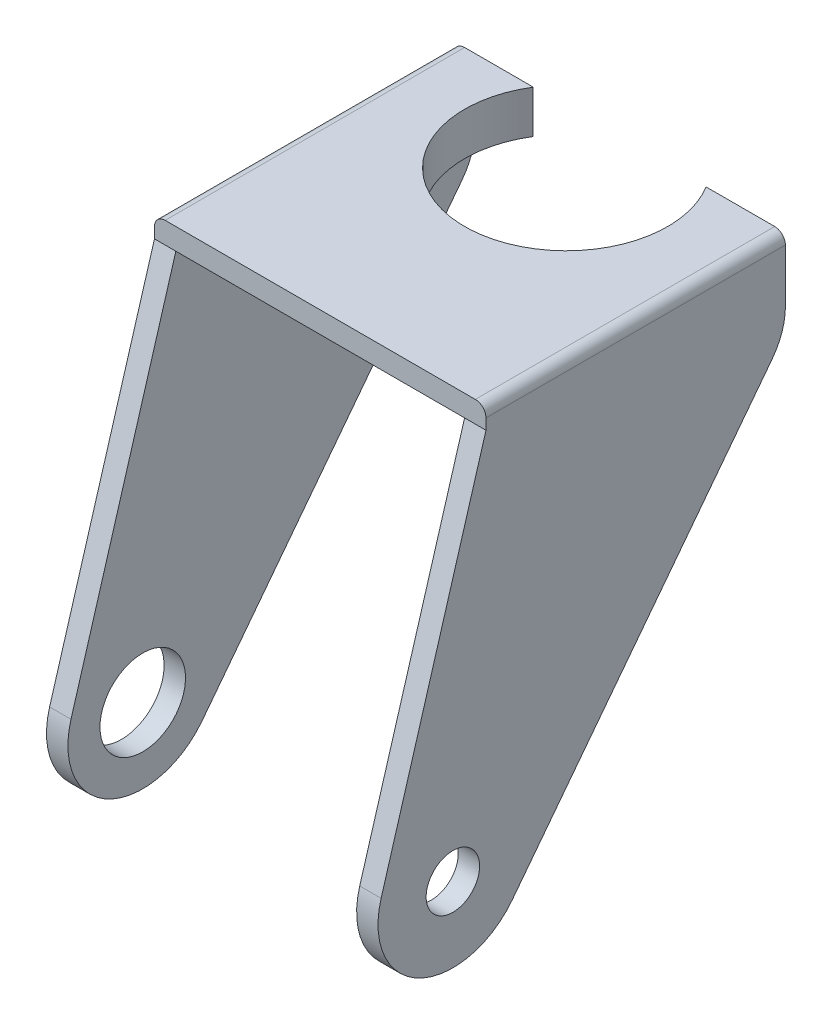
ISO-10303-21;
HEADER;
FILE_DESCRIPTION(('STEP AP214'),'2;1');
FILE_NAME('part.step','',(''),(''),'','','');
FILE_SCHEMA(('AUTOMOTIVE_DESIGN { 1 0 10303 214 1 1 1 1 }'));
ENDSEC;
DATA;
#1=APPLICATION_CONTEXT('core data for automotive mechanical design processes');
#2=APPLICATION_PROTOCOL_DEFINITION('international standard','automotive_design',2000,#1);
#3=PRODUCT_CONTEXT('',#1,'mechanical');
#4=PRODUCT('Part','Part','',(#3));
#5=PRODUCT_RELATED_PRODUCT_CATEGORY('part','',(#4));
#6=PRODUCT_DEFINITION_FORMATION('','',#4);
#7=PRODUCT_DEFINITION_CONTEXT('part definition',#1,'design');
#8=PRODUCT_DEFINITION('design','',#6,#7);
#9=PRODUCT_DEFINITION_SHAPE('','',#8);
#10=(LENGTH_UNIT() NAMED_UNIT(*) SI_UNIT(.MILLI.,.METRE.));
#11=(NAMED_UNIT(*) PLANE_ANGLE_UNIT() SI_UNIT($,.RADIAN.));
#12=(NAMED_UNIT(*) SI_UNIT($,.STERADIAN.) SOLID_ANGLE_UNIT());
#13=UNCERTAINTY_MEASURE_WITH_UNIT(LENGTH_MEASURE(1.E-05),#10,'distance_accuracy_value','');
#14=(GEOMETRIC_REPRESENTATION_CONTEXT(3) GLOBAL_UNCERTAINTY_ASSIGNED_CONTEXT((#13)) GLOBAL_UNIT_ASSIGNED_CONTEXT((#10,
#11,#12)) REPRESENTATION_CONTEXT('',''));
#15=CARTESIAN_POINT('',(0.,0.,0.));
#16=DIRECTION('',(0.,0.,1.));
#17=DIRECTION('',(1.,0.,0.));
#18=AXIS2_PLACEMENT_3D('',#15,#16,#17);
#19=CARTESIAN_POINT('',(-2.,36.9939994929025,-31.0965794572279));
#20=DIRECTION('',(0.,0.,-1.));
#21=DIRECTION('',(0.,1.,0.));
#22=AXIS2_PLACEMENT_3D('',#19,#20,#21);
#23=PLANE('',#22);
#24=DIRECTION('',(0.,1.,0.));
#25=VECTOR('',#24,1.);
#26=CARTESIAN_POINT('',(-31.,34.9939994929025,-31.0965794572279));
#27=LINE('',#26,#25);
#28=CARTESIAN_POINT('',(-31.,31.0323325454746,-31.0965794572279));
#29=VERTEX_POINT('',#28);
#30=CARTESIAN_POINT('',(-31.,35.9939994929025,-31.0965794572279));
#31=VERTEX_POINT('',#30);
#32=EDGE_CURVE('E209',#29,#31,#27,.T.);
#33=ORIENTED_EDGE('',*,*,#32,.T.);
#34=CARTESIAN_POINT('',(-30.,35.9939994929025,-31.0965794572279));
#35=DIRECTION('',(0.,0.,-1.));
#36=DIRECTION('',(0.,1.,0.));
#37=AXIS2_PLACEMENT_3D('',#34,#35,#36);
#38=CIRCLE('',#37,1.);
#39=CARTESIAN_POINT('',(-30.,36.9939994929025,-31.0965794572279));
#40=VERTEX_POINT('',#39);
#41=EDGE_CURVE('E280',#31,#40,#38,.T.);
#42=ORIENTED_EDGE('',*,*,#41,.T.);
#43=DIRECTION('',(1.,0.,0.));
#44=VECTOR('',#43,1.);
#45=CARTESIAN_POINT('',(-2.,36.9939994929025,-31.0965794572279));
#46=LINE('',#45,#44);
#47=CARTESIAN_POINT('',(-25.8561575886046,36.9939994929025,-31.0965794572279));
#48=VERTEX_POINT('',#47);
#49=EDGE_CURVE('E256',#40,#48,#46,.T.);
#50=ORIENTED_EDGE('',*,*,#49,.T.);
#51=DIRECTION('',(3.07167038101021E-13,1.,0.));
#52=VECTOR('',#51,1.);
#53=CARTESIAN_POINT('',(-25.8561575886046,36.9939994929098,-31.0965794572279));
#54=LINE('',#53,#52);
#55=CARTESIAN_POINT('',(-25.8561575886046,34.9939994929025,-31.0965794572279));
#56=VERTEX_POINT('',#55);
#57=EDGE_CURVE('E179',#56,#48,#54,.T.);
#58=ORIENTED_EDGE('',*,*,#57,.F.);
#59=DIRECTION('',(-1.,0.,0.));
#60=VECTOR('',#59,1.);
#61=CARTESIAN_POINT('',(-31.,34.9939994929025,-31.0965794572279));
#62=LINE('',#61,#60);
#63=CARTESIAN_POINT('',(-29.,34.9939994929025,-31.0965794572279));
#64=VERTEX_POINT('',#63);
#65=EDGE_CURVE('E200',#56,#64,#62,.T.);
#66=ORIENTED_EDGE('',*,*,#65,.T.);
#67=DIRECTION('',(0.,1.,0.));
#68=VECTOR('',#67,1.);
#69=CARTESIAN_POINT('',(-29.,36.9939994929025,-31.0965794572279));
#70=LINE('',#69,#68);
#71=CARTESIAN_POINT('',(-29.,31.0323325454746,-31.0965794572279));
#72=VERTEX_POINT('',#71);
#73=EDGE_CURVE('E326',#72,#64,#70,.T.);
#74=ORIENTED_EDGE('',*,*,#73,.F.);
#75=DIRECTION('',(-1.,0.,0.));
#76=VECTOR('',#75,1.);
#77=CARTESIAN_POINT('',(-29.,31.0323325454746,-31.0965794572279));
#78=LINE('',#77,#76);
#79=EDGE_CURVE('E345',#72,#29,#78,.T.);
#80=ORIENTED_EDGE('',*,*,#79,.T.);
#81=EDGE_LOOP('',(#33,#42,#50,#58,#66,#74,#80));
#82=FACE_BOUND('',#81,.T.);
#83=ADVANCED_FACE('F32',(#82),#23,.T.);
#84=CARTESIAN_POINT('',(0.,34.9939994929025,0.));
#85=DIRECTION('',(0.,1.,0.));
#86=DIRECTION('',(0.,0.,1.));
#87=AXIS2_PLACEMENT_3D('',#84,#85,#86);
#88=PLANE('',#87);
#89=ORIENTED_EDGE('',*,*,#65,.F.);
#90=CARTESIAN_POINT('',(-15.5,34.9939994929025,-26.0965794572279));
#91=DIRECTION('',(0.,1.,0.));
#92=DIRECTION('',(0.,0.,1.));
#93=AXIS2_PLACEMENT_3D('',#90,#91,#92);
#94=CIRCLE('',#93,11.5);
#95=CARTESIAN_POINT('',(-5.14384241139601,34.9939994929025,-31.0965794572279));
#96=VERTEX_POINT('',#95);
#97=EDGE_CURVE('E186',#56,#96,#94,.T.);
#98=ORIENTED_EDGE('',*,*,#97,.T.);
#99=CARTESIAN_POINT('',(-2.,34.9939994929025,-31.0965794572279));
#100=VERTEX_POINT('',#99);
#101=EDGE_CURVE('E197',#100,#96,#62,.T.);
#102=ORIENTED_EDGE('',*,*,#101,.F.);
#103=DIRECTION('',(0.,0.,1.));
#104=VECTOR('',#103,1.);
#105=CARTESIAN_POINT('',(-2.,34.9939994929025,0.));
#106=LINE('',#105,#104);
#107=CARTESIAN_POINT('',(-2.,34.9939994929025,-3.09657945722793));
#108=VERTEX_POINT('',#107);
#109=EDGE_CURVE('E215',#100,#108,#106,.T.);
#110=ORIENTED_EDGE('',*,*,#109,.T.);
#111=DIRECTION('',(1.,0.,0.));
#112=VECTOR('',#111,1.);
#113=CARTESIAN_POINT('',(-31.,34.9939994929025,-3.09657945722793));
#114=LINE('',#113,#112);
#115=CARTESIAN_POINT('',(-29.,34.9939994929025,-3.09657945722793));
#116=VERTEX_POINT('',#115);
#117=EDGE_CURVE('E294',#116,#108,#114,.T.);
#118=ORIENTED_EDGE('',*,*,#117,.F.);
#119=DIRECTION('',(0.,0.,1.));
#120=VECTOR('',#119,1.);
#121=CARTESIAN_POINT('',(-29.,34.9939994929025,0.));
#122=LINE('',#121,#120);
#123=EDGE_CURVE('E180',#64,#116,#122,.T.);
#124=ORIENTED_EDGE('',*,*,#123,.F.);
#125=EDGE_LOOP('',(#89,#98,#102,#110,#118,#124));
#126=FACE_BOUND('',#125,.T.);
#127=ADVANCED_FACE('F195',(#126),#88,.F.);
#128=CARTESIAN_POINT('',(-2.,0.,0.));
#129=DIRECTION('',(1.,0.,0.));
#130=DIRECTION('',(0.,0.,-1.));
#131=AXIS2_PLACEMENT_3D('',#128,#129,#130);
#132=PLANE('',#131);
#133=CARTESIAN_POINT('',(-2.,0.,0.));
#134=DIRECTION('',(1.,0.,0.));
#135=DIRECTION('',(0.,0.,-1.));
#136=AXIS2_PLACEMENT_3D('',#133,#134,#135);
#137=CIRCLE('',#136,2.5);
#138=CARTESIAN_POINT('',(-2.,0.,-2.5));
#139=VERTEX_POINT('',#138);
#140=EDGE_CURVE('E404',#139,#139,#137,.T.);
#141=ORIENTED_EDGE('',*,*,#140,.T.);
#142=EDGE_LOOP('',(#141));
#143=FACE_BOUND('',#142,.T.);
#144=ORIENTED_EDGE('',*,*,#109,.F.);
#145=DIRECTION('',(0.,1.,0.));
#146=VECTOR('',#145,1.);
#147=CARTESIAN_POINT('',(-2.,36.9939994929025,-31.0965794572279));
#148=LINE('',#147,#146);
#149=CARTESIAN_POINT('',(-2.,31.0323325454746,-31.0965794572279));
#150=VERTEX_POINT('',#149);
#151=EDGE_CURVE('E206',#150,#100,#148,.T.);
#152=ORIENTED_EDGE('',*,*,#151,.F.);
#153=CARTESIAN_POINT('',(-2.,31.0323325454745,-25.0965794572279));
#154=DIRECTION('',(1.,0.,0.));
#155=DIRECTION('',(0.,0.,1.));
#156=AXIS2_PLACEMENT_3D('',#153,#154,#155);
#157=CIRCLE('',#156,6.);
#158=CARTESIAN_POINT('',(-2.,27.3774774891413,-29.8549441466139));
#159=VERTEX_POINT('',#158);
#160=EDGE_CURVE('E226',#159,#150,#157,.T.);
#161=ORIENTED_EDGE('',*,*,#160,.F.);
#162=DIRECTION('',(0.,0.793060781564328,-0.609142509388876));
#163=VECTOR('',#162,1.);
#164=CARTESIAN_POINT('',(-2.,27.3774774891413,-29.8549441466139));
#165=LINE('',#164,#163);
#166=CARTESIAN_POINT('',(-2.,-4.26399756572213,-5.5514254709503));
#167=VERTEX_POINT('',#166);
#168=EDGE_CURVE('E222',#167,#159,#165,.T.);
#169=ORIENTED_EDGE('',*,*,#168,.F.);
#170=CARTESIAN_POINT('',(-2.,0.,0.));
#171=DIRECTION('',(1.,0.,0.));
#172=DIRECTION('',(0.,0.,-1.));
#173=AXIS2_PLACEMENT_3D('',#170,#171,#172);
#174=CIRCLE('',#173,7.);
#175=CARTESIAN_POINT('',(-2.,1.99399949290248,6.70999001655775));
#176=VERTEX_POINT('',#175);
#177=EDGE_CURVE('E219',#176,#167,#174,.T.);
#178=ORIENTED_EDGE('',*,*,#177,.F.);
#179=DIRECTION('',(0.,-0.958570002365392,0.28485707041464));
#180=VECTOR('',#179,1.);
#181=CARTESIAN_POINT('',(-2.,1.99399949290248,6.70999001655775));
#182=LINE('',#181,#180);
#183=EDGE_CURVE('E230',#108,#176,#182,.T.);
#184=ORIENTED_EDGE('',*,*,#183,.F.);
#185=EDGE_LOOP('',(#144,#152,#161,#169,#178,#184));
#186=FACE_BOUND('',#185,.T.);
#187=ADVANCED_FACE('F311',(#143,#186),#132,.F.);
#188=CARTESIAN_POINT('',(-2.,0.,0.));
#189=DIRECTION('',(1.,0.,0.));
#190=DIRECTION('',(0.,0.,-1.));
#191=AXIS2_PLACEMENT_3D('',#188,#189,#190);
#192=CYLINDRICAL_SURFACE('',#191,7.);
#193=CARTESIAN_POINT('',(0.,0.,0.));
#194=DIRECTION('',(1.,0.,0.));
#195=DIRECTION('',(0.,0.,-1.));
#196=AXIS2_PLACEMENT_3D('',#193,#194,#195);
#197=CIRCLE('',#196,7.);
#198=CARTESIAN_POINT('',(0.,1.99399949290248,6.70999001655775));
#199=VERTEX_POINT('',#198);
#200=CARTESIAN_POINT('',(0.,-4.26399756572213,-5.5514254709503));
#201=VERTEX_POINT('',#200);
#202=EDGE_CURVE('E218',#199,#201,#197,.T.);
#203=ORIENTED_EDGE('',*,*,#202,.F.);
#204=DIRECTION('',(1.,0.,0.));
#205=VECTOR('',#204,1.);
#206=CARTESIAN_POINT('',(-2.,1.99399949290248,6.70999001655775));
#207=LINE('',#206,#205);
#208=EDGE_CURVE('E248',#176,#199,#207,.T.);
#209=ORIENTED_EDGE('',*,*,#208,.F.);
#210=ORIENTED_EDGE('',*,*,#177,.T.);
#211=DIRECTION('',(1.,0.,0.));
#212=VECTOR('',#211,1.);
#213=CARTESIAN_POINT('',(-2.,-4.26399756572213,-5.5514254709503));
#214=LINE('',#213,#212);
#215=EDGE_CURVE('E233',#167,#201,#214,.T.);
#216=ORIENTED_EDGE('',*,*,#215,.T.);
#217=EDGE_LOOP('',(#203,#209,#210,#216));
#218=FACE_BOUND('',#217,.T.);
#219=ADVANCED_FACE('F301',(#218),#192,.T.);
#220=CARTESIAN_POINT('',(-2.,1.99399949290248,6.70999001655775));
#221=DIRECTION('',(0.,0.28485707041464,0.958570002365393));
#222=DIRECTION('',(0.,-0.958570002365393,0.28485707041464));
#223=AXIS2_PLACEMENT_3D('',#220,#221,#222);
#224=PLANE('',#223);
#225=DIRECTION('',(0.,-0.958570002365392,0.28485707041464));
#226=VECTOR('',#225,1.);
#227=CARTESIAN_POINT('',(0.,1.99399949290248,6.70999001655775));
#228=LINE('',#227,#226);
#229=CARTESIAN_POINT('',(0.,34.9939994929025,-3.09657945722793));
#230=VERTEX_POINT('',#229);
#231=EDGE_CURVE('E223',#230,#199,#228,.T.);
#232=ORIENTED_EDGE('',*,*,#231,.F.);
#233=DIRECTION('',(1.,0.,0.));
#234=VECTOR('',#233,1.);
#235=CARTESIAN_POINT('',(-2.,34.9939994929025,-3.09657945722793));
#236=LINE('',#235,#234);
#237=EDGE_CURVE('E250',#108,#230,#236,.T.);
#238=ORIENTED_EDGE('',*,*,#237,.F.);
#239=ORIENTED_EDGE('',*,*,#183,.T.);
#240=ORIENTED_EDGE('',*,*,#208,.T.);
#241=EDGE_LOOP('',(#232,#238,#239,#240));
#242=FACE_BOUND('',#241,.T.);
#243=ADVANCED_FACE('F297',(#242),#224,.T.);
#244=CARTESIAN_POINT('',(-2.,34.9939994929025,-3.09657945722793));
#245=DIRECTION('',(0.,0.,1.));
#246=DIRECTION('',(1.,0.,0.));
#247=AXIS2_PLACEMENT_3D('',#244,#245,#246);
#248=PLANE('',#247);
#249=DIRECTION('',(1.,0.,0.));
#250=VECTOR('',#249,1.);
#251=CARTESIAN_POINT('',(-2.,36.9939994929025,-3.09657945722793));
#252=LINE('',#251,#250);
#253=CARTESIAN_POINT('',(-30.,36.9939994929025,-3.09657945722793));
#254=VERTEX_POINT('',#253);
#255=CARTESIAN_POINT('',(-1.,36.9939994929025,-3.09657945722793));
#256=VERTEX_POINT('',#255);
#257=EDGE_CURVE('E253',#254,#256,#252,.T.);
#258=ORIENTED_EDGE('',*,*,#257,.F.);
#259=CARTESIAN_POINT('',(-30.,35.9939994929025,-3.09657945722793));
#260=DIRECTION('',(0.,0.,1.));
#261=DIRECTION('',(1.,0.,0.));
#262=AXIS2_PLACEMENT_3D('',#259,#260,#261);
#263=CIRCLE('',#262,1.);
#264=CARTESIAN_POINT('',(-31.,35.9939994929025,-3.09657945722793));
#265=VERTEX_POINT('',#264);
#266=EDGE_CURVE('E277',#254,#265,#263,.T.);
#267=ORIENTED_EDGE('',*,*,#266,.T.);
#268=DIRECTION('',(0.,1.,0.));
#269=VECTOR('',#268,1.);
#270=CARTESIAN_POINT('',(-31.,34.9939994929025,-3.09657945722793));
#271=LINE('',#270,#269);
#272=CARTESIAN_POINT('',(-31.,34.9939994929025,-3.09657945722793));
#273=VERTEX_POINT('',#272);
#274=EDGE_CURVE('E207',#273,#265,#271,.T.);
#275=ORIENTED_EDGE('',*,*,#274,.F.);
#276=EDGE_CURVE('E211',#273,#116,#114,.T.);
#277=ORIENTED_EDGE('',*,*,#276,.T.);
#278=ORIENTED_EDGE('',*,*,#117,.T.);
#279=ORIENTED_EDGE('',*,*,#237,.T.);
#280=DIRECTION('',(0.,-1.,0.));
#281=VECTOR('',#280,1.);
#282=CARTESIAN_POINT('',(0.,34.9939994929025,-3.09657945722793));
#283=LINE('',#282,#281);
#284=CARTESIAN_POINT('',(0.,35.9939994929025,-3.09657945722793));
#285=VERTEX_POINT('',#284);
#286=EDGE_CURVE('E244',#285,#230,#283,.T.);
#287=ORIENTED_EDGE('',*,*,#286,.F.);
#288=CARTESIAN_POINT('',(-1.,35.9939994929025,-3.09657945722793));
#289=DIRECTION('',(0.,0.,1.));
#290=DIRECTION('',(1.,0.,0.));
#291=AXIS2_PLACEMENT_3D('',#288,#289,#290);
#292=CIRCLE('',#291,1.);
#293=EDGE_CURVE('E275',#285,#256,#292,.T.);
#294=ORIENTED_EDGE('',*,*,#293,.T.);
#295=EDGE_LOOP('',(#258,#267,#275,#277,#278,#279,#287,#294));
#296=FACE_BOUND('',#295,.T.);
#297=ADVANCED_FACE('F289',(#296),#248,.T.);
#298=CARTESIAN_POINT('',(-2.,36.9939994929025,-3.09657945722793));
#299=DIRECTION('',(0.,1.,0.));
#300=DIRECTION('',(0.,0.,1.));
#301=AXIS2_PLACEMENT_3D('',#298,#299,#300);
#302=PLANE('',#301);
#303=ORIENTED_EDGE('',*,*,#49,.F.);
#304=DIRECTION('',(0.,0.,1.));
#305=VECTOR('',#304,1.);
#306=CARTESIAN_POINT('',(-30.,36.9939994929025,-3.09657945722793));
#307=LINE('',#306,#305);
#308=EDGE_CURVE('E272',#40,#254,#307,.T.);
#309=ORIENTED_EDGE('',*,*,#308,.T.);
#310=ORIENTED_EDGE('',*,*,#257,.T.);
#311=DIRECTION('',(0.,0.,1.));
#312=VECTOR('',#311,1.);
#313=CARTESIAN_POINT('',(-1.,36.9939994929025,-3.09657945722793));
#314=LINE('',#313,#312);
#315=CARTESIAN_POINT('',(-1.,36.9939994929025,-31.0965794572279));
#316=VERTEX_POINT('',#315);
#317=EDGE_CURVE('E270',#256,#316,#314,.F.);
#318=ORIENTED_EDGE('',*,*,#317,.T.);
#319=CARTESIAN_POINT('',(-5.14384241139601,36.9939994929025,-31.0965794572279));
#320=VERTEX_POINT('',#319);
#321=EDGE_CURVE('E258',#320,#316,#46,.T.);
#322=ORIENTED_EDGE('',*,*,#321,.F.);
#323=DIRECTION('',(0.99999820524696,0.,-0.00189459833726096));
#324=VECTOR('',#323,1.);
#325=CARTESIAN_POINT('',(-2.05305994306522,36.9939994929025,-31.102435259063));
#326=LINE('',#325,#324);
#327=CARTESIAN_POINT('',(-7.41958555029964,36.9939994929025,-31.0922678303226));
#328=VERTEX_POINT('',#327);
#329=EDGE_CURVE('E176',#328,#320,#326,.T.);
#330=ORIENTED_EDGE('',*,*,#329,.F.);
#331=CARTESIAN_POINT('',(-15.5,36.9939994929025,-26.0965794572279));
#332=DIRECTION('',(0.,1.,0.));
#333=DIRECTION('',(0.,0.,1.));
#334=AXIS2_PLACEMENT_3D('',#331,#332,#333);
#335=CIRCLE('',#334,9.5);
#336=CARTESIAN_POINT('',(-23.5804144497004,36.9939994929025,-31.0922678303226));
#337=VERTEX_POINT('',#336);
#338=EDGE_CURVE('E267',#337,#328,#335,.T.);
#339=ORIENTED_EDGE('',*,*,#338,.F.);
#340=DIRECTION('',(0.99999820524696,0.,0.00189459833725892));
#341=VECTOR('',#340,1.);
#342=CARTESIAN_POINT('',(-1.94703697351204,36.9939994929025,-31.0512811957661));
#343=LINE('',#342,#341);
#344=EDGE_CURVE('E395',#48,#337,#343,.T.);
#345=ORIENTED_EDGE('',*,*,#344,.F.);
#346=EDGE_LOOP('',(#303,#309,#310,#318,#322,#330,#339,#345));
#347=FACE_BOUND('',#346,.T.);
#348=ADVANCED_FACE('F366',(#347),#302,.T.);
#349=ORIENTED_EDGE('',*,*,#321,.T.);
#350=CARTESIAN_POINT('',(-1.,35.9939994929025,-31.0965794572279));
#351=DIRECTION('',(0.,0.,-1.));
#352=DIRECTION('',(0.,1.,0.));
#353=AXIS2_PLACEMENT_3D('',#350,#351,#352);
#354=CIRCLE('',#353,1.);
#355=CARTESIAN_POINT('',(0.,35.9939994929025,-31.0965794572279));
#356=VERTEX_POINT('',#355);
#357=EDGE_CURVE('E11',#316,#356,#354,.T.);
#358=ORIENTED_EDGE('',*,*,#357,.T.);
#359=DIRECTION('',(0.,1.,0.));
#360=VECTOR('',#359,1.);
#361=CARTESIAN_POINT('',(0.,36.9939994929025,-31.0965794572279));
#362=LINE('',#361,#360);
#363=CARTESIAN_POINT('',(0.,31.0323325454746,-31.0965794572279));
#364=VERTEX_POINT('',#363);
#365=EDGE_CURVE('E242',#364,#356,#362,.T.);
#366=ORIENTED_EDGE('',*,*,#365,.F.);
#367=DIRECTION('',(1.,0.,0.));
#368=VECTOR('',#367,1.);
#369=CARTESIAN_POINT('',(-2.,31.0323325454746,-31.0965794572279));
#370=LINE('',#369,#368);
#371=EDGE_CURVE('E259',#150,#364,#370,.T.);
#372=ORIENTED_EDGE('',*,*,#371,.F.);
#373=ORIENTED_EDGE('',*,*,#151,.T.);
#374=ORIENTED_EDGE('',*,*,#101,.T.);
#375=DIRECTION('',(3.0716703810069E-13,-1.,0.));
#376=VECTOR('',#375,1.);
#377=CARTESIAN_POINT('',(-5.14384241139601,36.9939994929015,-31.0965794572279));
#378=LINE('',#377,#376);
#379=EDGE_CURVE('E169',#320,#96,#378,.T.);
#380=ORIENTED_EDGE('',*,*,#379,.F.);
#381=EDGE_LOOP('',(#349,#358,#366,#372,#373,#374,#380));
#382=FACE_BOUND('',#381,.T.);
#383=ADVANCED_FACE('F204',(#382),#23,.T.);
#384=CARTESIAN_POINT('',(-2.,31.0323325454745,-25.0965794572279));
#385=DIRECTION('',(1.,0.,0.));
#386=DIRECTION('',(0.,0.,-1.));
#387=AXIS2_PLACEMENT_3D('',#384,#385,#386);
#388=CYLINDRICAL_SURFACE('',#387,6.);
#389=CARTESIAN_POINT('',(0.,31.0323325454745,-25.0965794572279));
#390=DIRECTION('',(1.,0.,0.));
#391=DIRECTION('',(0.,0.,1.));
#392=AXIS2_PLACEMENT_3D('',#389,#390,#391);
#393=CIRCLE('',#392,6.);
#394=CARTESIAN_POINT('',(0.,27.3774774891413,-29.8549441466139));
#395=VERTEX_POINT('',#394);
#396=EDGE_CURVE('E239',#395,#364,#393,.T.);
#397=ORIENTED_EDGE('',*,*,#396,.F.);
#398=DIRECTION('',(1.,0.,0.));
#399=VECTOR('',#398,1.);
#400=CARTESIAN_POINT('',(-2.,27.3774774891413,-29.8549441466139));
#401=LINE('',#400,#399);
#402=EDGE_CURVE('E261',#159,#395,#401,.T.);
#403=ORIENTED_EDGE('',*,*,#402,.F.);
#404=ORIENTED_EDGE('',*,*,#160,.T.);
#405=ORIENTED_EDGE('',*,*,#371,.T.);
#406=EDGE_LOOP('',(#397,#403,#404,#405));
#407=FACE_BOUND('',#406,.T.);
#408=ADVANCED_FACE('F309',(#407),#388,.T.);
#409=CARTESIAN_POINT('',(-2.,27.3774774891413,-29.8549441466139));
#410=DIRECTION('',(0.,-0.609142509388876,-0.793060781564328));
#411=DIRECTION('',(0.,0.793060781564328,-0.609142509388876));
#412=AXIS2_PLACEMENT_3D('',#409,#410,#411);
#413=PLANE('',#412);
#414=DIRECTION('',(0.,0.793060781564328,-0.609142509388876));
#415=VECTOR('',#414,1.);
#416=CARTESIAN_POINT('',(0.,27.3774774891413,-29.8549441466139));
#417=LINE('',#416,#415);
#418=EDGE_CURVE('E236',#201,#395,#417,.T.);
#419=ORIENTED_EDGE('',*,*,#418,.F.);
#420=ORIENTED_EDGE('',*,*,#215,.F.);
#421=ORIENTED_EDGE('',*,*,#168,.T.);
#422=ORIENTED_EDGE('',*,*,#402,.T.);
#423=EDGE_LOOP('',(#419,#420,#421,#422));
#424=FACE_BOUND('',#423,.T.);
#425=ADVANCED_FACE('F305',(#424),#413,.T.);
#426=CARTESIAN_POINT('',(0.,0.,0.));
#427=DIRECTION('',(1.,0.,0.));
#428=DIRECTION('',(0.,0.,-1.));
#429=AXIS2_PLACEMENT_3D('',#426,#427,#428);
#430=PLANE('',#429);
#431=CARTESIAN_POINT('',(0.,0.,0.));
#432=DIRECTION('',(1.,0.,0.));
#433=DIRECTION('',(0.,0.,-1.));
#434=AXIS2_PLACEMENT_3D('',#431,#432,#433);
#435=CIRCLE('',#434,2.5);
#436=CARTESIAN_POINT('',(0.,0.,-2.5));
#437=VERTEX_POINT('',#436);
#438=EDGE_CURVE('E407',#437,#437,#435,.T.);
#439=ORIENTED_EDGE('',*,*,#438,.F.);
#440=EDGE_LOOP('',(#439));
#441=FACE_BOUND('',#440,.T.);
#442=ORIENTED_EDGE('',*,*,#365,.T.);
#443=DIRECTION('',(0.,0.,1.));
#444=VECTOR('',#443,1.);
#445=CARTESIAN_POINT('',(0.,35.9939994929025,0.));
#446=LINE('',#445,#444);
#447=EDGE_CURVE('E40',#356,#285,#446,.T.);
#448=ORIENTED_EDGE('',*,*,#447,.T.);
#449=ORIENTED_EDGE('',*,*,#286,.T.);
#450=ORIENTED_EDGE('',*,*,#231,.T.);
#451=ORIENTED_EDGE('',*,*,#202,.T.);
#452=ORIENTED_EDGE('',*,*,#418,.T.);
#453=ORIENTED_EDGE('',*,*,#396,.T.);
#454=EDGE_LOOP('',(#442,#448,#449,#450,#451,#452,#453));
#455=FACE_BOUND('',#454,.T.);
#456=ADVANCED_FACE('F285',(#441,#455),#430,.T.);
#457=CARTESIAN_POINT('',(-31.,34.9939994929025,-31.0965794572279));
#458=DIRECTION('',(-1.,0.,0.));
#459=DIRECTION('',(0.,0.,1.));
#460=AXIS2_PLACEMENT_3D('',#457,#458,#459);
#461=PLANE('',#460);
#462=CARTESIAN_POINT('',(-31.,0.,0.));
#463=DIRECTION('',(-1.,0.,0.));
#464=DIRECTION('',(0.,0.,1.));
#465=AXIS2_PLACEMENT_3D('',#462,#463,#464);
#466=CIRCLE('',#465,4.);
#467=CARTESIAN_POINT('',(-31.,0.,4.));
#468=VERTEX_POINT('',#467);
#469=EDGE_CURVE('E398',#468,#468,#466,.F.);
#470=ORIENTED_EDGE('',*,*,#469,.T.);
#471=EDGE_LOOP('',(#470));
#472=FACE_BOUND('',#471,.T.);
#473=ORIENTED_EDGE('',*,*,#274,.T.);
#474=DIRECTION('',(0.,0.,1.));
#475=VECTOR('',#474,1.);
#476=CARTESIAN_POINT('',(-31.,35.9939994929025,-31.0965794572279));
#477=LINE('',#476,#475);
#478=EDGE_CURVE('E53',#265,#31,#477,.F.);
#479=ORIENTED_EDGE('',*,*,#478,.T.);
#480=ORIENTED_EDGE('',*,*,#32,.F.);
#481=CARTESIAN_POINT('',(-31.,31.0323325454745,-25.0965794572279));
#482=DIRECTION('',(1.,0.,0.));
#483=DIRECTION('',(0.,0.,1.));
#484=AXIS2_PLACEMENT_3D('',#481,#482,#483);
#485=CIRCLE('',#484,6.);
#486=CARTESIAN_POINT('',(-31.,27.3774774891413,-29.8549441466139));
#487=VERTEX_POINT('',#486);
#488=EDGE_CURVE('E339',#487,#29,#485,.T.);
#489=ORIENTED_EDGE('',*,*,#488,.F.);
#490=DIRECTION('',(0.,0.793060781564328,-0.609142509388876));
#491=VECTOR('',#490,1.);
#492=CARTESIAN_POINT('',(-31.,27.3774774891413,-29.8549441466139));
#493=LINE('',#492,#491);
#494=CARTESIAN_POINT('',(-31.,-4.26399756572213,-5.5514254709503));
#495=VERTEX_POINT('',#494);
#496=EDGE_CURVE('E337',#495,#487,#493,.T.);
#497=ORIENTED_EDGE('',*,*,#496,.F.);
#498=CARTESIAN_POINT('',(-31.,0.,0.));
#499=DIRECTION('',(1.,0.,0.));
#500=DIRECTION('',(0.,0.,-1.));
#501=AXIS2_PLACEMENT_3D('',#498,#499,#500);
#502=CIRCLE('',#501,7.);
#503=CARTESIAN_POINT('',(-31.,1.99399949290248,6.70999001655775));
#504=VERTEX_POINT('',#503);
#505=EDGE_CURVE('E201',#504,#495,#502,.T.);
#506=ORIENTED_EDGE('',*,*,#505,.F.);
#507=DIRECTION('',(0.,-0.958570002365392,0.28485707041464));
#508=VECTOR('',#507,1.);
#509=CARTESIAN_POINT('',(-31.,1.99399949290248,6.70999001655775));
#510=LINE('',#509,#508);
#511=EDGE_CURVE('E319',#273,#504,#510,.T.);
#512=ORIENTED_EDGE('',*,*,#511,.F.);
#513=EDGE_LOOP('',(#473,#479,#480,#489,#497,#506,#512));
#514=FACE_BOUND('',#513,.T.);
#515=ADVANCED_FACE('F356',(#472,#514),#461,.T.);
#516=CARTESIAN_POINT('',(-29.,0.,0.));
#517=DIRECTION('',(-1.,0.,0.));
#518=DIRECTION('',(0.,0.,-1.));
#519=AXIS2_PLACEMENT_3D('',#516,#517,#518);
#520=PLANE('',#519);
#521=CARTESIAN_POINT('',(-29.,0.,0.));
#522=DIRECTION('',(-1.,0.,0.));
#523=DIRECTION('',(0.,0.,1.));
#524=AXIS2_PLACEMENT_3D('',#521,#522,#523);
#525=CIRCLE('',#524,4.);
#526=CARTESIAN_POINT('',(-29.,0.,4.));
#527=VERTEX_POINT('',#526);
#528=EDGE_CURVE('E401',#527,#527,#525,.T.);
#529=ORIENTED_EDGE('',*,*,#528,.T.);
#530=EDGE_LOOP('',(#529));
#531=FACE_BOUND('',#530,.T.);
#532=ORIENTED_EDGE('',*,*,#73,.T.);
#533=ORIENTED_EDGE('',*,*,#123,.T.);
#534=DIRECTION('',(0.,-0.958570002365392,0.28485707041464));
#535=VECTOR('',#534,1.);
#536=CARTESIAN_POINT('',(-29.,1.99399949290248,6.70999001655775));
#537=LINE('',#536,#535);
#538=CARTESIAN_POINT('',(-29.,1.99399949290248,6.70999001655775));
#539=VERTEX_POINT('',#538);
#540=EDGE_CURVE('E321',#116,#539,#537,.T.);
#541=ORIENTED_EDGE('',*,*,#540,.T.);
#542=CARTESIAN_POINT('',(-29.,0.,0.));
#543=DIRECTION('',(1.,0.,0.));
#544=DIRECTION('',(0.,0.,-1.));
#545=AXIS2_PLACEMENT_3D('',#542,#543,#544);
#546=CIRCLE('',#545,7.);
#547=CARTESIAN_POINT('',(-29.,-4.26399756572213,-5.5514254709503));
#548=VERTEX_POINT('',#547);
#549=EDGE_CURVE('E343',#539,#548,#546,.T.);
#550=ORIENTED_EDGE('',*,*,#549,.T.);
#551=DIRECTION('',(0.,0.793060781564328,-0.609142509388876));
#552=VECTOR('',#551,1.);
#553=CARTESIAN_POINT('',(-29.,27.3774774891413,-29.8549441466139));
#554=LINE('',#553,#552);
#555=CARTESIAN_POINT('',(-29.,27.3774774891413,-29.8549441466139));
#556=VERTEX_POINT('',#555);
#557=EDGE_CURVE('E372',#548,#556,#554,.T.);
#558=ORIENTED_EDGE('',*,*,#557,.T.);
#559=CARTESIAN_POINT('',(-29.,31.0323325454745,-25.0965794572279));
#560=DIRECTION('',(1.,0.,0.));
#561=DIRECTION('',(0.,0.,1.));
#562=AXIS2_PLACEMENT_3D('',#559,#560,#561);
#563=CIRCLE('',#562,6.);
#564=EDGE_CURVE('E331',#556,#72,#563,.T.);
#565=ORIENTED_EDGE('',*,*,#564,.T.);
#566=EDGE_LOOP('',(#532,#533,#541,#550,#558,#565));
#567=FACE_BOUND('',#566,.T.);
#568=ADVANCED_FACE('F376',(#531,#567),#520,.F.);
#569=CARTESIAN_POINT('',(-29.,0.,0.));
#570=DIRECTION('',(-1.,0.,0.));
#571=DIRECTION('',(0.,0.,-1.));
#572=AXIS2_PLACEMENT_3D('',#569,#570,#571);
#573=CYLINDRICAL_SURFACE('',#572,7.);
#574=ORIENTED_EDGE('',*,*,#505,.T.);
#575=DIRECTION('',(-1.,0.,0.));
#576=VECTOR('',#575,1.);
#577=CARTESIAN_POINT('',(-29.,-4.26399756572213,-5.5514254709503));
#578=LINE('',#577,#576);
#579=EDGE_CURVE('E325',#548,#495,#578,.T.);
#580=ORIENTED_EDGE('',*,*,#579,.F.);
#581=ORIENTED_EDGE('',*,*,#549,.F.);
#582=DIRECTION('',(-1.,0.,0.));
#583=VECTOR('',#582,1.);
#584=CARTESIAN_POINT('',(-29.,1.99399949290248,6.70999001655775));
#585=LINE('',#584,#583);
#586=EDGE_CURVE('E312',#539,#504,#585,.T.);
#587=ORIENTED_EDGE('',*,*,#586,.T.);
#588=EDGE_LOOP('',(#574,#580,#581,#587));
#589=FACE_BOUND('',#588,.T.);
#590=ADVANCED_FACE('F371',(#589),#573,.T.);
#591=CARTESIAN_POINT('',(-29.,1.99399949290248,6.70999001655775));
#592=DIRECTION('',(0.,0.28485707041464,0.958570002365393));
#593=DIRECTION('',(0.,-0.958570002365393,0.28485707041464));
#594=AXIS2_PLACEMENT_3D('',#591,#592,#593);
#595=PLANE('',#594);
#596=ORIENTED_EDGE('',*,*,#511,.T.);
#597=ORIENTED_EDGE('',*,*,#586,.F.);
#598=ORIENTED_EDGE('',*,*,#540,.F.);
#599=ORIENTED_EDGE('',*,*,#276,.F.);
#600=EDGE_LOOP('',(#596,#597,#598,#599));
#601=FACE_BOUND('',#600,.T.);
#602=ADVANCED_FACE('F317',(#601),#595,.T.);
#603=CARTESIAN_POINT('',(-29.,31.0323325454745,-25.0965794572279));
#604=DIRECTION('',(-1.,0.,0.));
#605=DIRECTION('',(0.,0.,-1.));
#606=AXIS2_PLACEMENT_3D('',#603,#604,#605);
#607=CYLINDRICAL_SURFACE('',#606,6.);
#608=ORIENTED_EDGE('',*,*,#488,.T.);
#609=ORIENTED_EDGE('',*,*,#79,.F.);
#610=ORIENTED_EDGE('',*,*,#564,.F.);
#611=DIRECTION('',(-1.,0.,0.));
#612=VECTOR('',#611,1.);
#613=CARTESIAN_POINT('',(-29.,27.3774774891413,-29.8549441466139));
#614=LINE('',#613,#612);
#615=EDGE_CURVE('E329',#556,#487,#614,.T.);
#616=ORIENTED_EDGE('',*,*,#615,.T.);
#617=EDGE_LOOP('',(#608,#609,#610,#616));
#618=FACE_BOUND('',#617,.T.);
#619=ADVANCED_FACE('F353',(#618),#607,.T.);
#620=CARTESIAN_POINT('',(-29.,27.3774774891413,-29.8549441466139));
#621=DIRECTION('',(0.,-0.609142509388876,-0.793060781564328));
#622=DIRECTION('',(0.,0.793060781564328,-0.609142509388876));
#623=AXIS2_PLACEMENT_3D('',#620,#621,#622);
#624=PLANE('',#623);
#625=ORIENTED_EDGE('',*,*,#496,.T.);
#626=ORIENTED_EDGE('',*,*,#615,.F.);
#627=ORIENTED_EDGE('',*,*,#557,.F.);
#628=ORIENTED_EDGE('',*,*,#579,.T.);
#629=EDGE_LOOP('',(#625,#626,#627,#628));
#630=FACE_BOUND('',#629,.T.);
#631=ADVANCED_FACE('F475',(#630),#624,.T.);
#632=CARTESIAN_POINT('',(-15.5,32.9939994929025,-26.0965794572279));
#633=DIRECTION('',(0.,1.,0.));
#634=DIRECTION('',(0.,0.,1.));
#635=AXIS2_PLACEMENT_3D('',#632,#633,#634);
#636=CYLINDRICAL_SURFACE('',#635,9.5);
#637=DIRECTION('',(0.,1.,0.));
#638=VECTOR('',#637,1.);
#639=CARTESIAN_POINT('',(-23.5804144497004,32.9939994929025,-31.0922678303226));
#640=LINE('',#639,#638);
#641=CARTESIAN_POINT('',(-23.5804144497004,32.9939994929025,-31.0922678303226));
#642=VERTEX_POINT('',#641);
#643=EDGE_CURVE('E384',#642,#337,#640,.T.);
#644=ORIENTED_EDGE('',*,*,#643,.T.);
#645=ORIENTED_EDGE('',*,*,#338,.T.);
#646=DIRECTION('',(0.,1.,0.));
#647=VECTOR('',#646,1.);
#648=CARTESIAN_POINT('',(-7.41958555029964,32.9939994929025,-31.0922678303226));
#649=LINE('',#648,#647);
#650=CARTESIAN_POINT('',(-7.41958555029964,32.9939994929025,-31.0922678303226));
#651=VERTEX_POINT('',#650);
#652=EDGE_CURVE('E191',#651,#328,#649,.T.);
#653=ORIENTED_EDGE('',*,*,#652,.F.);
#654=CARTESIAN_POINT('',(-15.5,32.9939994929025,-26.0965794572279));
#655=DIRECTION('',(0.,-1.,0.));
#656=DIRECTION('',(0.,0.,1.));
#657=AXIS2_PLACEMENT_3D('',#654,#655,#656);
#658=CIRCLE('',#657,9.5);
#659=EDGE_CURVE('E392',#651,#642,#658,.T.);
#660=ORIENTED_EDGE('',*,*,#659,.T.);
#661=EDGE_LOOP('',(#644,#645,#653,#660));
#662=FACE_BOUND('',#661,.T.);
#663=ADVANCED_FACE('F470',(#662),#636,.F.);
#664=CARTESIAN_POINT('',(-7.41958555029964,32.9939994929025,-31.0922678303226));
#665=DIRECTION('',(-0.00189459833726096,0.,-0.99999820524696));
#666=DIRECTION('',(-0.99999820524696,0.,0.00189459833726096));
#667=AXIS2_PLACEMENT_3D('',#664,#665,#666);
#668=PLANE('',#667);
#669=ORIENTED_EDGE('',*,*,#652,.T.);
#670=ORIENTED_EDGE('',*,*,#329,.T.);
#671=ORIENTED_EDGE('',*,*,#379,.T.);
#672=DIRECTION('',(0.,1.,0.));
#673=VECTOR('',#672,1.);
#674=CARTESIAN_POINT('',(-5.14384241139601,32.9939994929025,-31.0965794572279));
#675=LINE('',#674,#673);
#676=CARTESIAN_POINT('',(-5.14384241139601,32.9939994929025,-31.0965794572279));
#677=VERTEX_POINT('',#676);
#678=EDGE_CURVE('E173',#677,#96,#675,.T.);
#679=ORIENTED_EDGE('',*,*,#678,.F.);
#680=DIRECTION('',(-0.99999820524696,0.,0.00189459833726096));
#681=VECTOR('',#680,1.);
#682=CARTESIAN_POINT('',(-7.41958555029964,32.9939994929025,-31.0922678303226));
#683=LINE('',#682,#681);
#684=EDGE_CURVE('E386',#677,#651,#683,.T.);
#685=ORIENTED_EDGE('',*,*,#684,.T.);
#686=EDGE_LOOP('',(#669,#670,#671,#679,#685));
#687=FACE_BOUND('',#686,.T.);
#688=ADVANCED_FACE('F171',(#687),#668,.T.);
#689=CARTESIAN_POINT('',(-15.5,32.9939994929025,-26.0965794572279));
#690=DIRECTION('',(0.,1.,0.));
#691=DIRECTION('',(0.,0.,1.));
#692=AXIS2_PLACEMENT_3D('',#689,#690,#691);
#693=CYLINDRICAL_SURFACE('',#692,11.5);
#694=ORIENTED_EDGE('',*,*,#97,.F.);
#695=DIRECTION('',(0.,1.,0.));
#696=VECTOR('',#695,1.);
#697=CARTESIAN_POINT('',(-25.856157588604,32.9939994929025,-31.0965794572279));
#698=LINE('',#697,#696);
#699=CARTESIAN_POINT('',(-25.856157588604,32.9939994929025,-31.0965794572279));
#700=VERTEX_POINT('',#699);
#701=EDGE_CURVE('E192',#700,#56,#698,.T.);
#702=ORIENTED_EDGE('',*,*,#701,.F.);
#703=CARTESIAN_POINT('',(-15.5,32.9939994929025,-26.0965794572279));
#704=DIRECTION('',(0.,1.,0.));
#705=DIRECTION('',(0.,0.,1.));
#706=AXIS2_PLACEMENT_3D('',#703,#704,#705);
#707=CIRCLE('',#706,11.5);
#708=EDGE_CURVE('E189',#700,#677,#707,.T.);
#709=ORIENTED_EDGE('',*,*,#708,.T.);
#710=ORIENTED_EDGE('',*,*,#678,.T.);
#711=EDGE_LOOP('',(#694,#702,#709,#710));
#712=FACE_BOUND('',#711,.T.);
#713=ADVANCED_FACE('F185',(#712),#693,.T.);
#714=CARTESIAN_POINT('',(-23.5804144497004,32.9939994929025,-31.0922678303226));
#715=DIRECTION('',(0.00189459833726248,0.,-0.99999820524696));
#716=DIRECTION('',(-0.99999820524696,0.,-0.00189459833726248));
#717=AXIS2_PLACEMENT_3D('',#714,#715,#716);
#718=PLANE('',#717);
#719=ORIENTED_EDGE('',*,*,#701,.T.);
#720=ORIENTED_EDGE('',*,*,#57,.T.);
#721=ORIENTED_EDGE('',*,*,#344,.T.);
#722=ORIENTED_EDGE('',*,*,#643,.F.);
#723=DIRECTION('',(-0.99999820524696,0.,-0.00189459833726248));
#724=VECTOR('',#723,1.);
#725=CARTESIAN_POINT('',(-23.5804144497004,32.9939994929025,-31.0922678303226));
#726=LINE('',#725,#724);
#727=EDGE_CURVE('E383',#642,#700,#726,.T.);
#728=ORIENTED_EDGE('',*,*,#727,.T.);
#729=EDGE_LOOP('',(#719,#720,#721,#722,#728));
#730=FACE_BOUND('',#729,.T.);
#731=ADVANCED_FACE('F381',(#730),#718,.T.);
#732=CARTESIAN_POINT('',(-15.5,32.9939994929025,-26.0965794572279));
#733=DIRECTION('',(0.,1.,0.));
#734=DIRECTION('',(0.,0.,1.));
#735=AXIS2_PLACEMENT_3D('',#732,#733,#734);
#736=PLANE('',#735);
#737=ORIENTED_EDGE('',*,*,#659,.F.);
#738=ORIENTED_EDGE('',*,*,#684,.F.);
#739=ORIENTED_EDGE('',*,*,#708,.F.);
#740=ORIENTED_EDGE('',*,*,#727,.F.);
#741=EDGE_LOOP('',(#737,#738,#739,#740));
#742=FACE_BOUND('',#741,.T.);
#743=ADVANCED_FACE('F452',(#742),#736,.F.);
#744=CARTESIAN_POINT('',(-30.,35.9939994929025,-3.09657945722793));
#745=DIRECTION('',(0.,0.,1.));
#746=DIRECTION('',(1.,0.,0.));
#747=AXIS2_PLACEMENT_3D('',#744,#745,#746);
#748=CYLINDRICAL_SURFACE('',#747,1.);
#749=ORIENTED_EDGE('',*,*,#41,.F.);
#750=ORIENTED_EDGE('',*,*,#478,.F.);
#751=ORIENTED_EDGE('',*,*,#266,.F.);
#752=ORIENTED_EDGE('',*,*,#308,.F.);
#753=EDGE_LOOP('',(#749,#750,#751,#752));
#754=FACE_BOUND('',#753,.T.);
#755=ADVANCED_FACE('F364',(#754),#748,.T.);
#756=CARTESIAN_POINT('',(-1.,35.9939994929025,0.));
#757=DIRECTION('',(0.,0.,1.));
#758=DIRECTION('',(1.,0.,0.));
#759=AXIS2_PLACEMENT_3D('',#756,#757,#758);
#760=CYLINDRICAL_SURFACE('',#759,1.);
#761=ORIENTED_EDGE('',*,*,#357,.F.);
#762=ORIENTED_EDGE('',*,*,#317,.F.);
#763=ORIENTED_EDGE('',*,*,#293,.F.);
#764=ORIENTED_EDGE('',*,*,#447,.F.);
#765=EDGE_LOOP('',(#761,#762,#763,#764));
#766=FACE_BOUND('',#765,.T.);
#767=ADVANCED_FACE('F34',(#766),#760,.T.);
#768=CARTESIAN_POINT('',(-39.,0.,0.));
#769=DIRECTION('',(1.,0.,0.));
#770=DIRECTION('',(0.,0.,-1.));
#771=AXIS2_PLACEMENT_3D('',#768,#769,#770);
#772=CYLINDRICAL_SURFACE('',#771,4.);
#773=ORIENTED_EDGE('',*,*,#469,.F.);
#774=EDGE_LOOP('',(#773));
#775=FACE_BOUND('',#774,.T.);
#776=ORIENTED_EDGE('',*,*,#528,.F.);
#777=EDGE_LOOP('',(#776));
#778=FACE_BOUND('',#777,.T.);
#779=ADVANCED_FACE('F457',(#775,#778),#772,.F.);
#780=CARTESIAN_POINT('',(-10.,0.,0.));
#781=DIRECTION('',(1.,0.,0.));
#782=DIRECTION('',(0.,0.,-1.));
#783=AXIS2_PLACEMENT_3D('',#780,#781,#782);
#784=CYLINDRICAL_SURFACE('',#783,2.5);
#785=ORIENTED_EDGE('',*,*,#438,.T.);
#786=EDGE_LOOP('',(#785));
#787=FACE_BOUND('',#786,.T.);
#788=ORIENTED_EDGE('',*,*,#140,.F.);
#789=EDGE_LOOP('',(#788));
#790=FACE_BOUND('',#789,.T.);
#791=ADVANCED_FACE('F411',(#787,#790),#784,.F.);
#792=CLOSED_SHELL('',(#83,#127,#187,#219,#243,#297,#348,#383,#408,#425,#456,#515,#568,#590,#602,
#619,#631,#663,#688,#713,#731,#743,#755,#767,#779,#791));
#793=MANIFOLD_SOLID_BREP('B2',#792);
#794=ADVANCED_BREP_SHAPE_REPRESENTATION('',(#18,#793),#14);
#795=SHAPE_DEFINITION_REPRESENTATION(#9,#794);
ENDSEC;
END-ISO-10303-21;
